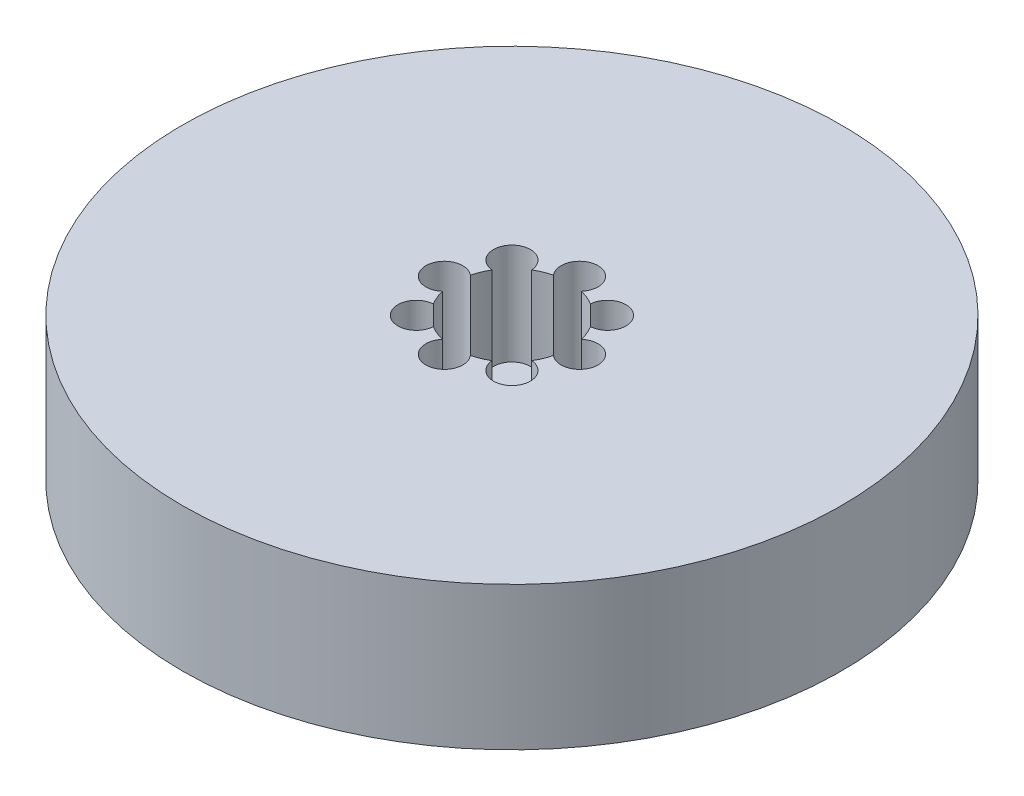
ISO-10303-21;
HEADER;
FILE_DESCRIPTION(('STEP AP214'),'2;1');
FILE_NAME('part.step','',(''),(''),'','','');
FILE_SCHEMA(('AUTOMOTIVE_DESIGN { 1 0 10303 214 1 1 1 1 }'));
ENDSEC;
DATA;
#1=APPLICATION_CONTEXT('core data for automotive mechanical design processes');
#2=APPLICATION_PROTOCOL_DEFINITION('international standard','automotive_design',2000,#1);
#3=PRODUCT_CONTEXT('',#1,'mechanical');
#4=PRODUCT('Part','Part','',(#3));
#5=PRODUCT_RELATED_PRODUCT_CATEGORY('part','',(#4));
#6=PRODUCT_DEFINITION_FORMATION('','',#4);
#7=PRODUCT_DEFINITION_CONTEXT('part definition',#1,'design');
#8=PRODUCT_DEFINITION('design','',#6,#7);
#9=PRODUCT_DEFINITION_SHAPE('','',#8);
#10=(LENGTH_UNIT() NAMED_UNIT(*) SI_UNIT(.MILLI.,.METRE.));
#11=(NAMED_UNIT(*) PLANE_ANGLE_UNIT() SI_UNIT($,.RADIAN.));
#12=(NAMED_UNIT(*) SI_UNIT($,.STERADIAN.) SOLID_ANGLE_UNIT());
#13=UNCERTAINTY_MEASURE_WITH_UNIT(LENGTH_MEASURE(1.E-05),#10,'distance_accuracy_value','');
#14=(GEOMETRIC_REPRESENTATION_CONTEXT(3) GLOBAL_UNCERTAINTY_ASSIGNED_CONTEXT((#13)) GLOBAL_UNIT_ASSIGNED_CONTEXT((#10,
#11,#12)) REPRESENTATION_CONTEXT('',''));
#15=CARTESIAN_POINT('',(0.,0.,0.));
#16=DIRECTION('',(0.,0.,1.));
#17=DIRECTION('',(1.,0.,0.));
#18=AXIS2_PLACEMENT_3D('',#15,#16,#17);
#19=CARTESIAN_POINT('',(0.,25.,0.));
#20=DIRECTION('',(0.,-1.,0.));
#21=DIRECTION('',(0.,0.,-1.));
#22=AXIS2_PLACEMENT_3D('',#19,#20,#21);
#23=CYLINDRICAL_SURFACE('',#22,57.5);
#24=CARTESIAN_POINT('',(0.,25.,0.));
#25=DIRECTION('',(0.,1.,0.));
#26=DIRECTION('',(0.,0.,1.));
#27=AXIS2_PLACEMENT_3D('',#24,#25,#26);
#28=CIRCLE('',#27,57.5);
#29=CARTESIAN_POINT('',(0.,25.,57.5));
#30=VERTEX_POINT('',#29);
#31=EDGE_CURVE('E195',#30,#30,#28,.T.);
#32=ORIENTED_EDGE('',*,*,#31,.F.);
#33=EDGE_LOOP('',(#32));
#34=FACE_BOUND('',#33,.T.);
#35=CARTESIAN_POINT('',(0.,0.,0.));
#36=DIRECTION('',(0.,1.,0.));
#37=DIRECTION('',(0.,0.,1.));
#38=AXIS2_PLACEMENT_3D('',#35,#36,#37);
#39=CIRCLE('',#38,57.5);
#40=CARTESIAN_POINT('',(0.,0.,57.5));
#41=VERTEX_POINT('',#40);
#42=EDGE_CURVE('E179',#41,#41,#39,.T.);
#43=ORIENTED_EDGE('',*,*,#42,.T.);
#44=EDGE_LOOP('',(#43));
#45=FACE_BOUND('',#44,.T.);
#46=ADVANCED_FACE('F39',(#34,#45),#23,.T.);
#47=CARTESIAN_POINT('',(0.,25.,0.));
#48=DIRECTION('',(0.,1.,0.));
#49=DIRECTION('',(0.,0.,1.));
#50=AXIS2_PLACEMENT_3D('',#47,#48,#49);
#51=PLANE('',#50);
#52=CARTESIAN_POINT('',(0.,25.,11.7935122991508));
#53=DIRECTION('',(0.,1.,0.));
#54=DIRECTION('',(1.,0.,0.));
#55=AXIS2_PLACEMENT_3D('',#52,#53,#54);
#56=CIRCLE('',#55,3.21900226584226);
#57=CARTESIAN_POINT('',(-2.44272235426867,25.,9.69706695346362));
#58=VERTEX_POINT('',#57);
#59=CARTESIAN_POINT('',(2.44272235426874,25.,9.6970669534636));
#60=VERTEX_POINT('',#59);
#61=EDGE_CURVE('E176',#58,#60,#56,.T.);
#62=ORIENTED_EDGE('',*,*,#61,.F.);
#63=CARTESIAN_POINT('',(0.,25.,0.));
#64=DIRECTION('',(0.,1.,0.));
#65=DIRECTION('',(0.,0.,1.));
#66=AXIS2_PLACEMENT_3D('',#63,#64,#65);
#67=CIRCLE('',#66,10.);
#68=CARTESIAN_POINT('',(-5.12959625915471,25.,8.58412734167347));
#69=VERTEX_POINT('',#68);
#70=EDGE_CURVE('E166',#69,#58,#67,.T.);
#71=ORIENTED_EDGE('',*,*,#70,.F.);
#72=CARTESIAN_POINT('',(-8.33927252073648,25.,8.33927252073651));
#73=DIRECTION('',(0.,1.,0.));
#74=DIRECTION('',(0.707106781186549,0.,0.707106781186546));
#75=AXIS2_PLACEMENT_3D('',#72,#73,#74);
#76=CIRCLE('',#75,3.21900226584226);
#77=CARTESIAN_POINT('',(-8.58412734167345,25.,5.12959625915474));
#78=VERTEX_POINT('',#77);
#79=EDGE_CURVE('E147',#78,#69,#76,.T.);
#80=ORIENTED_EDGE('',*,*,#79,.F.);
#81=CARTESIAN_POINT('',(-9.69706695346361,25.,2.4427223542687));
#82=VERTEX_POINT('',#81);
#83=EDGE_CURVE('E180',#82,#78,#67,.T.);
#84=ORIENTED_EDGE('',*,*,#83,.F.);
#85=CARTESIAN_POINT('',(-11.7935122991508,25.,0.));
#86=DIRECTION('',(0.,1.,0.));
#87=DIRECTION('',(0.,0.,1.));
#88=AXIS2_PLACEMENT_3D('',#85,#86,#87);
#89=CIRCLE('',#88,3.21900226584226);
#90=CARTESIAN_POINT('',(-9.69706695346361,25.,-2.4427223542687));
#91=VERTEX_POINT('',#90);
#92=EDGE_CURVE('E186',#91,#82,#89,.T.);
#93=ORIENTED_EDGE('',*,*,#92,.F.);
#94=CARTESIAN_POINT('',(-8.58412734167352,25.,-5.12959625915462));
#95=VERTEX_POINT('',#94);
#96=EDGE_CURVE('E182',#95,#91,#67,.T.);
#97=ORIENTED_EDGE('',*,*,#96,.F.);
#98=CARTESIAN_POINT('',(-8.3392725207366,25.,-8.33927252073639));
#99=DIRECTION('',(0.,1.,0.));
#100=DIRECTION('',(-0.707106781186539,0.,0.707106781186556));
#101=AXIS2_PLACEMENT_3D('',#98,#99,#100);
#102=CIRCLE('',#101,3.21900226584226);
#103=CARTESIAN_POINT('',(-5.12959625915483,25.,-8.5841273416734));
#104=VERTEX_POINT('',#103);
#105=EDGE_CURVE('E446',#104,#95,#102,.T.);
#106=ORIENTED_EDGE('',*,*,#105,.F.);
#107=CARTESIAN_POINT('',(-2.4427223542688,25.,-9.69706695346358));
#108=VERTEX_POINT('',#107);
#109=EDGE_CURVE('E452',#108,#104,#67,.T.);
#110=ORIENTED_EDGE('',*,*,#109,.F.);
#111=CARTESIAN_POINT('',(-1.23530484335706E-13,25.,-11.7935122991508));
#112=DIRECTION('',(0.,1.,0.));
#113=DIRECTION('',(-1.,0.,0.));
#114=AXIS2_PLACEMENT_3D('',#111,#112,#113);
#115=CIRCLE('',#114,3.21900226584226);
#116=CARTESIAN_POINT('',(2.4427223542686,25.,-9.69706695346363));
#117=VERTEX_POINT('',#116);
#118=EDGE_CURVE('E477',#117,#108,#115,.T.);
#119=ORIENTED_EDGE('',*,*,#118,.F.);
#120=CARTESIAN_POINT('',(5.12959625915465,25.,-8.58412734167351));
#121=VERTEX_POINT('',#120);
#122=EDGE_CURVE('E460',#121,#117,#67,.T.);
#123=ORIENTED_EDGE('',*,*,#122,.F.);
#124=CARTESIAN_POINT('',(8.33927252073642,25.,-8.33927252073657));
#125=DIRECTION('',(0.,1.,0.));
#126=DIRECTION('',(-0.707106781186554,0.,-0.707106781186541));
#127=AXIS2_PLACEMENT_3D('',#124,#125,#126);
#128=CIRCLE('',#127,3.21900226584226);
#129=CARTESIAN_POINT('',(8.58412734167342,25.,-5.1295962591548));
#130=VERTEX_POINT('',#129);
#131=EDGE_CURVE('E464',#130,#121,#128,.T.);
#132=ORIENTED_EDGE('',*,*,#131,.F.);
#133=CARTESIAN_POINT('',(9.69706695346361,25.,-2.4427223542687));
#134=VERTEX_POINT('',#133);
#135=EDGE_CURVE('E459',#134,#130,#67,.T.);
#136=ORIENTED_EDGE('',*,*,#135,.F.);
#137=CARTESIAN_POINT('',(11.7935122991508,25.,0.));
#138=DIRECTION('',(0.,1.,0.));
#139=DIRECTION('',(0.,0.,-1.));
#140=AXIS2_PLACEMENT_3D('',#137,#138,#139);
#141=CIRCLE('',#140,3.21900226584226);
#142=CARTESIAN_POINT('',(9.69706695346361,25.,2.4427223542687));
#143=VERTEX_POINT('',#142);
#144=EDGE_CURVE('E469',#143,#134,#141,.T.);
#145=ORIENTED_EDGE('',*,*,#144,.F.);
#146=CARTESIAN_POINT('',(8.58412734167349,25.,5.12959625915468));
#147=VERTEX_POINT('',#146);
#148=EDGE_CURVE('E181',#147,#143,#67,.T.);
#149=ORIENTED_EDGE('',*,*,#148,.F.);
#150=CARTESIAN_POINT('',(8.33927252073654,25.,8.33927252073645));
#151=DIRECTION('',(0.,1.,0.));
#152=DIRECTION('',(0.707106781186544,0.,-0.707106781186551));
#153=AXIS2_PLACEMENT_3D('',#150,#151,#152);
#154=CIRCLE('',#153,3.21900226584226);
#155=CARTESIAN_POINT('',(5.12959625915477,25.,8.58412734167343));
#156=VERTEX_POINT('',#155);
#157=EDGE_CURVE('E475',#156,#147,#154,.T.);
#158=ORIENTED_EDGE('',*,*,#157,.F.);
#159=EDGE_CURVE('E177',#60,#156,#67,.T.);
#160=ORIENTED_EDGE('',*,*,#159,.F.);
#161=EDGE_LOOP('',(#62,#71,#80,#84,#93,#97,#106,#110,#119,#123,#132,#136,#145,#149,#158,#160));
#162=FACE_BOUND('',#161,.T.);
#163=ORIENTED_EDGE('',*,*,#31,.T.);
#164=EDGE_LOOP('',(#163));
#165=FACE_BOUND('',#164,.T.);
#166=ADVANCED_FACE('F172',(#162,#165),#51,.T.);
#167=CARTESIAN_POINT('',(0.,0.,0.));
#168=DIRECTION('',(0.,1.,0.));
#169=DIRECTION('',(0.,0.,1.));
#170=AXIS2_PLACEMENT_3D('',#167,#168,#169);
#171=PLANE('',#170);
#172=CARTESIAN_POINT('',(0.,0.,0.));
#173=DIRECTION('',(0.,1.,0.));
#174=DIRECTION('',(0.,0.,1.));
#175=AXIS2_PLACEMENT_3D('',#172,#173,#174);
#176=CIRCLE('',#175,10.);
#177=CARTESIAN_POINT('',(0.,0.,10.));
#178=VERTEX_POINT('',#177);
#179=EDGE_CURVE('E187',#178,#178,#176,.T.);
#180=ORIENTED_EDGE('',*,*,#179,.T.);
#181=EDGE_LOOP('',(#180));
#182=FACE_BOUND('',#181,.T.);
#183=ORIENTED_EDGE('',*,*,#42,.F.);
#184=EDGE_LOOP('',(#183));
#185=FACE_BOUND('',#184,.T.);
#186=ADVANCED_FACE('F270',(#182,#185),#171,.F.);
#187=CARTESIAN_POINT('',(0.,25.,0.));
#188=DIRECTION('',(0.,-1.,0.));
#189=DIRECTION('',(0.,0.,-1.));
#190=AXIS2_PLACEMENT_3D('',#187,#188,#189);
#191=CYLINDRICAL_SURFACE('',#190,10.);
#192=DIRECTION('',(0.,1.,0.));
#193=VECTOR('',#192,1.);
#194=CARTESIAN_POINT('',(-2.44272235426867,16.1651851618745,9.69706695346362));
#195=LINE('',#194,#193);
#196=CARTESIAN_POINT('',(-2.44272235426867,7.33037032374907,9.69706695346362));
#197=VERTEX_POINT('',#196);
#198=EDGE_CURVE('E11',#197,#58,#195,.T.);
#199=ORIENTED_EDGE('',*,*,#198,.F.);
#200=CARTESIAN_POINT('',(0.,7.33037032374907,0.));
#201=DIRECTION('',(0.,1.,0.));
#202=DIRECTION('',(0.,0.,1.));
#203=AXIS2_PLACEMENT_3D('',#200,#201,#202);
#204=CIRCLE('',#203,10.);
#205=CARTESIAN_POINT('',(2.44272235426874,7.33037032374907,9.6970669534636));
#206=VERTEX_POINT('',#205);
#207=EDGE_CURVE('E250',#197,#206,#204,.T.);
#208=ORIENTED_EDGE('',*,*,#207,.T.);
#209=DIRECTION('',(0.,1.,0.));
#210=VECTOR('',#209,1.);
#211=CARTESIAN_POINT('',(2.44272235426874,16.1651851618745,9.6970669534636));
#212=LINE('',#211,#210);
#213=EDGE_CURVE('E46',#60,#206,#212,.F.);
#214=ORIENTED_EDGE('',*,*,#213,.F.);
#215=ORIENTED_EDGE('',*,*,#159,.T.);
#216=DIRECTION('',(0.,1.,0.));
#217=VECTOR('',#216,1.);
#218=CARTESIAN_POINT('',(5.12959625915477,16.1651851618745,8.58412734167343));
#219=LINE('',#218,#217);
#220=CARTESIAN_POINT('',(5.12959625915477,7.33037032374907,8.58412734167343));
#221=VERTEX_POINT('',#220);
#222=EDGE_CURVE('E244',#221,#156,#219,.T.);
#223=ORIENTED_EDGE('',*,*,#222,.F.);
#224=CARTESIAN_POINT('',(0.,7.33037032374907,0.));
#225=DIRECTION('',(0.,1.,0.));
#226=DIRECTION('',(0.,0.,1.));
#227=AXIS2_PLACEMENT_3D('',#224,#225,#226);
#228=CIRCLE('',#227,10.);
#229=CARTESIAN_POINT('',(8.58412734167349,7.33037032374907,5.12959625915468));
#230=VERTEX_POINT('',#229);
#231=EDGE_CURVE('E238',#221,#230,#228,.T.);
#232=ORIENTED_EDGE('',*,*,#231,.T.);
#233=DIRECTION('',(0.,1.,0.));
#234=VECTOR('',#233,1.);
#235=CARTESIAN_POINT('',(8.58412734167349,16.1651851618745,5.12959625915468));
#236=LINE('',#235,#234);
#237=EDGE_CURVE('E242',#147,#230,#236,.F.);
#238=ORIENTED_EDGE('',*,*,#237,.F.);
#239=ORIENTED_EDGE('',*,*,#148,.T.);
#240=DIRECTION('',(0.,1.,0.));
#241=VECTOR('',#240,1.);
#242=CARTESIAN_POINT('',(9.69706695346361,16.1651851618745,2.4427223542687));
#243=LINE('',#242,#241);
#244=CARTESIAN_POINT('',(9.69706695346361,7.33037032374907,2.4427223542687));
#245=VERTEX_POINT('',#244);
#246=EDGE_CURVE('E236',#245,#143,#243,.T.);
#247=ORIENTED_EDGE('',*,*,#246,.F.);
#248=CARTESIAN_POINT('',(0.,7.33037032374907,0.));
#249=DIRECTION('',(0.,1.,0.));
#250=DIRECTION('',(0.,0.,1.));
#251=AXIS2_PLACEMENT_3D('',#248,#249,#250);
#252=CIRCLE('',#251,10.);
#253=CARTESIAN_POINT('',(9.69706695346361,7.33037032374907,-2.4427223542687));
#254=VERTEX_POINT('',#253);
#255=EDGE_CURVE('E235',#245,#254,#252,.T.);
#256=ORIENTED_EDGE('',*,*,#255,.T.);
#257=DIRECTION('',(0.,1.,0.));
#258=VECTOR('',#257,1.);
#259=CARTESIAN_POINT('',(9.69706695346361,16.1651851618745,-2.4427223542687));
#260=LINE('',#259,#258);
#261=EDGE_CURVE('E234',#134,#254,#260,.F.);
#262=ORIENTED_EDGE('',*,*,#261,.F.);
#263=ORIENTED_EDGE('',*,*,#135,.T.);
#264=DIRECTION('',(0.,1.,0.));
#265=VECTOR('',#264,1.);
#266=CARTESIAN_POINT('',(8.58412734167342,16.1651851618745,-5.1295962591548));
#267=LINE('',#266,#265);
#268=CARTESIAN_POINT('',(8.58412734167342,7.33037032374907,-5.1295962591548));
#269=VERTEX_POINT('',#268);
#270=EDGE_CURVE('E229',#269,#130,#267,.T.);
#271=ORIENTED_EDGE('',*,*,#270,.F.);
#272=CARTESIAN_POINT('',(0.,7.33037032374907,0.));
#273=DIRECTION('',(0.,1.,0.));
#274=DIRECTION('',(0.,0.,1.));
#275=AXIS2_PLACEMENT_3D('',#272,#273,#274);
#276=CIRCLE('',#275,10.);
#277=CARTESIAN_POINT('',(5.12959625915465,7.33037032374907,-8.58412734167351));
#278=VERTEX_POINT('',#277);
#279=EDGE_CURVE('E221',#269,#278,#276,.T.);
#280=ORIENTED_EDGE('',*,*,#279,.T.);
#281=DIRECTION('',(0.,1.,0.));
#282=VECTOR('',#281,1.);
#283=CARTESIAN_POINT('',(5.12959625915465,16.1651851618745,-8.5841273416735));
#284=LINE('',#283,#282);
#285=EDGE_CURVE('E230',#121,#278,#284,.F.);
#286=ORIENTED_EDGE('',*,*,#285,.F.);
#287=ORIENTED_EDGE('',*,*,#122,.T.);
#288=DIRECTION('',(0.,1.,0.));
#289=VECTOR('',#288,1.);
#290=CARTESIAN_POINT('',(2.4427223542686,16.1651851618745,-9.69706695346363));
#291=LINE('',#290,#289);
#292=CARTESIAN_POINT('',(2.4427223542686,7.33037032374907,-9.69706695346363));
#293=VERTEX_POINT('',#292);
#294=EDGE_CURVE('E225',#293,#117,#291,.T.);
#295=ORIENTED_EDGE('',*,*,#294,.F.);
#296=CARTESIAN_POINT('',(0.,7.33037032374907,0.));
#297=DIRECTION('',(0.,1.,0.));
#298=DIRECTION('',(0.,0.,1.));
#299=AXIS2_PLACEMENT_3D('',#296,#297,#298);
#300=CIRCLE('',#299,10.);
#301=CARTESIAN_POINT('',(-2.4427223542688,7.33037032374907,-9.69706695346358));
#302=VERTEX_POINT('',#301);
#303=EDGE_CURVE('E216',#293,#302,#300,.T.);
#304=ORIENTED_EDGE('',*,*,#303,.T.);
#305=DIRECTION('',(0.,1.,0.));
#306=VECTOR('',#305,1.);
#307=CARTESIAN_POINT('',(-2.4427223542688,16.1651851618745,-9.69706695346358));
#308=LINE('',#307,#306);
#309=EDGE_CURVE('E218',#108,#302,#308,.F.);
#310=ORIENTED_EDGE('',*,*,#309,.F.);
#311=ORIENTED_EDGE('',*,*,#109,.T.);
#312=DIRECTION('',(0.,1.,0.));
#313=VECTOR('',#312,1.);
#314=CARTESIAN_POINT('',(-5.12959625915483,16.1651851618745,-8.5841273416734));
#315=LINE('',#314,#313);
#316=CARTESIAN_POINT('',(-5.12959625915483,7.33037032374907,-8.5841273416734));
#317=VERTEX_POINT('',#316);
#318=EDGE_CURVE('E212',#317,#104,#315,.T.);
#319=ORIENTED_EDGE('',*,*,#318,.F.);
#320=CARTESIAN_POINT('',(0.,7.33037032374907,0.));
#321=DIRECTION('',(0.,1.,0.));
#322=DIRECTION('',(0.,0.,1.));
#323=AXIS2_PLACEMENT_3D('',#320,#321,#322);
#324=CIRCLE('',#323,10.);
#325=CARTESIAN_POINT('',(-8.58412734167352,7.33037032374907,-5.12959625915462));
#326=VERTEX_POINT('',#325);
#327=EDGE_CURVE('E208',#317,#326,#324,.T.);
#328=ORIENTED_EDGE('',*,*,#327,.T.);
#329=DIRECTION('',(0.,1.,0.));
#330=VECTOR('',#329,1.);
#331=CARTESIAN_POINT('',(-8.58412734167352,16.1651851618745,-5.12959625915462));
#332=LINE('',#331,#330);
#333=EDGE_CURVE('E211',#95,#326,#332,.F.);
#334=ORIENTED_EDGE('',*,*,#333,.F.);
#335=ORIENTED_EDGE('',*,*,#96,.T.);
#336=DIRECTION('',(0.,1.,0.));
#337=VECTOR('',#336,1.);
#338=CARTESIAN_POINT('',(-9.69706695346361,16.1651851618745,-2.4427223542687));
#339=LINE('',#338,#337);
#340=CARTESIAN_POINT('',(-9.69706695346361,7.33037032374907,-2.4427223542687));
#341=VERTEX_POINT('',#340);
#342=EDGE_CURVE('E201',#341,#91,#339,.T.);
#343=ORIENTED_EDGE('',*,*,#342,.F.);
#344=CARTESIAN_POINT('',(0.,7.33037032374907,0.));
#345=DIRECTION('',(0.,1.,0.));
#346=DIRECTION('',(0.,0.,1.));
#347=AXIS2_PLACEMENT_3D('',#344,#345,#346);
#348=CIRCLE('',#347,10.);
#349=CARTESIAN_POINT('',(-9.69706695346361,7.33037032374907,2.4427223542687));
#350=VERTEX_POINT('',#349);
#351=EDGE_CURVE('E194',#341,#350,#348,.T.);
#352=ORIENTED_EDGE('',*,*,#351,.T.);
#353=DIRECTION('',(0.,1.,0.));
#354=VECTOR('',#353,1.);
#355=CARTESIAN_POINT('',(-9.69706695346361,16.1651851618745,2.4427223542687));
#356=LINE('',#355,#354);
#357=EDGE_CURVE('E199',#82,#350,#356,.F.);
#358=ORIENTED_EDGE('',*,*,#357,.F.);
#359=ORIENTED_EDGE('',*,*,#83,.T.);
#360=DIRECTION('',(0.,1.,0.));
#361=VECTOR('',#360,1.);
#362=CARTESIAN_POINT('',(-8.58412734167345,16.1651851618745,5.12959625915474));
#363=LINE('',#362,#361);
#364=CARTESIAN_POINT('',(-8.58412734167345,7.33037032374907,5.12959625915474));
#365=VERTEX_POINT('',#364);
#366=EDGE_CURVE('E160',#365,#78,#363,.T.);
#367=ORIENTED_EDGE('',*,*,#366,.F.);
#368=CARTESIAN_POINT('',(0.,7.33037032374907,0.));
#369=DIRECTION('',(0.,1.,0.));
#370=DIRECTION('',(0.,0.,1.));
#371=AXIS2_PLACEMENT_3D('',#368,#369,#370);
#372=CIRCLE('',#371,10.);
#373=CARTESIAN_POINT('',(-5.12959625915471,7.33037032374907,8.58412734167347));
#374=VERTEX_POINT('',#373);
#375=EDGE_CURVE('E168',#365,#374,#372,.T.);
#376=ORIENTED_EDGE('',*,*,#375,.T.);
#377=DIRECTION('',(0.,1.,0.));
#378=VECTOR('',#377,1.);
#379=CARTESIAN_POINT('',(-5.12959625915471,16.1651851618745,8.58412734167347));
#380=LINE('',#379,#378);
#381=EDGE_CURVE('E152',#69,#374,#380,.F.);
#382=ORIENTED_EDGE('',*,*,#381,.F.);
#383=ORIENTED_EDGE('',*,*,#70,.T.);
#384=EDGE_LOOP('',(#199,#208,#214,#215,#223,#232,#238,#239,#247,#256,#262,#263,#271,#280,#286,
#287,#295,#304,#310,#311,#319,#328,#334,#335,#343,#352,#358,#359,#367,#376,#382,#383));
#385=FACE_BOUND('',#384,.T.);
#386=ORIENTED_EDGE('',*,*,#179,.F.);
#387=EDGE_LOOP('',(#386));
#388=FACE_BOUND('',#387,.T.);
#389=ADVANCED_FACE('F170',(#385,#388),#191,.F.);
#390=CARTESIAN_POINT('',(-11.7935122991508,7.33037032374907,0.));
#391=DIRECTION('',(0.,1.,0.));
#392=DIRECTION('',(0.,0.,1.));
#393=AXIS2_PLACEMENT_3D('',#390,#391,#392);
#394=CYLINDRICAL_SURFACE('',#393,3.21900226584226);
#395=ORIENTED_EDGE('',*,*,#342,.T.);
#396=ORIENTED_EDGE('',*,*,#92,.T.);
#397=ORIENTED_EDGE('',*,*,#357,.T.);
#398=CARTESIAN_POINT('',(-11.7935122991508,7.33037032374907,0.));
#399=DIRECTION('',(0.,1.,0.));
#400=DIRECTION('',(0.,0.,1.));
#401=AXIS2_PLACEMENT_3D('',#398,#399,#400);
#402=CIRCLE('',#401,3.21900226584226);
#403=EDGE_CURVE('E191',#341,#350,#402,.T.);
#404=ORIENTED_EDGE('',*,*,#403,.F.);
#405=EDGE_LOOP('',(#395,#396,#397,#404));
#406=FACE_BOUND('',#405,.T.);
#407=ADVANCED_FACE('F279',(#406),#394,.F.);
#408=CARTESIAN_POINT('',(-11.7935122991508,7.33037032374907,0.));
#409=DIRECTION('',(0.,1.,0.));
#410=DIRECTION('',(0.,0.,1.));
#411=AXIS2_PLACEMENT_3D('',#408,#409,#410);
#412=PLANE('',#411);
#413=ORIENTED_EDGE('',*,*,#403,.T.);
#414=ORIENTED_EDGE('',*,*,#351,.F.);
#415=EDGE_LOOP('',(#413,#414));
#416=FACE_BOUND('',#415,.T.);
#417=ADVANCED_FACE('F285',(#416),#412,.T.);
#418=CARTESIAN_POINT('',(-8.33927252073648,7.33037032374907,8.33927252073651));
#419=DIRECTION('',(0.,1.,0.));
#420=DIRECTION('',(0.,0.,1.));
#421=AXIS2_PLACEMENT_3D('',#418,#419,#420);
#422=CYLINDRICAL_SURFACE('',#421,3.21900226584226);
#423=ORIENTED_EDGE('',*,*,#366,.T.);
#424=ORIENTED_EDGE('',*,*,#79,.T.);
#425=ORIENTED_EDGE('',*,*,#381,.T.);
#426=CARTESIAN_POINT('',(-8.33927252073648,7.33037032374907,8.33927252073651));
#427=DIRECTION('',(0.,1.,0.));
#428=DIRECTION('',(0.707106781186549,0.,0.707106781186546));
#429=AXIS2_PLACEMENT_3D('',#426,#427,#428);
#430=CIRCLE('',#429,3.21900226584226);
#431=EDGE_CURVE('E165',#365,#374,#430,.T.);
#432=ORIENTED_EDGE('',*,*,#431,.F.);
#433=EDGE_LOOP('',(#423,#424,#425,#432));
#434=FACE_BOUND('',#433,.T.);
#435=ADVANCED_FACE('F155',(#434),#422,.F.);
#436=CARTESIAN_POINT('',(-8.33927252073648,7.33037032374907,8.33927252073651));
#437=DIRECTION('',(0.,1.,0.));
#438=DIRECTION('',(0.707106781186549,0.,0.707106781186546));
#439=AXIS2_PLACEMENT_3D('',#436,#437,#438);
#440=PLANE('',#439);
#441=ORIENTED_EDGE('',*,*,#431,.T.);
#442=ORIENTED_EDGE('',*,*,#375,.F.);
#443=EDGE_LOOP('',(#441,#442));
#444=FACE_BOUND('',#443,.T.);
#445=ADVANCED_FACE('F288',(#444),#440,.T.);
#446=CARTESIAN_POINT('',(-8.3392725207366,7.33037032374907,-8.33927252073639));
#447=DIRECTION('',(0.,1.,0.));
#448=DIRECTION('',(0.,0.,1.));
#449=AXIS2_PLACEMENT_3D('',#446,#447,#448);
#450=CYLINDRICAL_SURFACE('',#449,3.21900226584226);
#451=ORIENTED_EDGE('',*,*,#318,.T.);
#452=ORIENTED_EDGE('',*,*,#105,.T.);
#453=ORIENTED_EDGE('',*,*,#333,.T.);
#454=CARTESIAN_POINT('',(-8.3392725207366,7.33037032374907,-8.33927252073639));
#455=DIRECTION('',(0.,1.,0.));
#456=DIRECTION('',(-0.707106781186539,0.,0.707106781186556));
#457=AXIS2_PLACEMENT_3D('',#454,#455,#456);
#458=CIRCLE('',#457,3.21900226584226);
#459=EDGE_CURVE('E447',#317,#326,#458,.T.);
#460=ORIENTED_EDGE('',*,*,#459,.F.);
#461=EDGE_LOOP('',(#451,#452,#453,#460));
#462=FACE_BOUND('',#461,.T.);
#463=ADVANCED_FACE('F295',(#462),#450,.F.);
#464=CARTESIAN_POINT('',(-8.3392725207366,7.33037032374907,-8.33927252073639));
#465=DIRECTION('',(0.,1.,0.));
#466=DIRECTION('',(-0.707106781186539,0.,0.707106781186556));
#467=AXIS2_PLACEMENT_3D('',#464,#465,#466);
#468=PLANE('',#467);
#469=ORIENTED_EDGE('',*,*,#459,.T.);
#470=ORIENTED_EDGE('',*,*,#327,.F.);
#471=EDGE_LOOP('',(#469,#470));
#472=FACE_BOUND('',#471,.T.);
#473=ADVANCED_FACE('F375',(#472),#468,.T.);
#474=CARTESIAN_POINT('',(-1.23530484335706E-13,7.33037032374907,-11.7935122991508));
#475=DIRECTION('',(0.,1.,0.));
#476=DIRECTION('',(0.,0.,1.));
#477=AXIS2_PLACEMENT_3D('',#474,#475,#476);
#478=CYLINDRICAL_SURFACE('',#477,3.21900226584226);
#479=ORIENTED_EDGE('',*,*,#294,.T.);
#480=ORIENTED_EDGE('',*,*,#118,.T.);
#481=ORIENTED_EDGE('',*,*,#309,.T.);
#482=CARTESIAN_POINT('',(-1.23530484335706E-13,7.33037032374907,-11.7935122991508));
#483=DIRECTION('',(0.,1.,0.));
#484=DIRECTION('',(-1.,0.,0.));
#485=AXIS2_PLACEMENT_3D('',#482,#483,#484);
#486=CIRCLE('',#485,3.21900226584226);
#487=EDGE_CURVE('E467',#293,#302,#486,.T.);
#488=ORIENTED_EDGE('',*,*,#487,.F.);
#489=EDGE_LOOP('',(#479,#480,#481,#488));
#490=FACE_BOUND('',#489,.T.);
#491=ADVANCED_FACE('F361',(#490),#478,.F.);
#492=CARTESIAN_POINT('',(-1.23530484335706E-13,7.33037032374907,-11.7935122991508));
#493=DIRECTION('',(0.,1.,0.));
#494=DIRECTION('',(-1.,0.,0.));
#495=AXIS2_PLACEMENT_3D('',#492,#493,#494);
#496=PLANE('',#495);
#497=ORIENTED_EDGE('',*,*,#487,.T.);
#498=ORIENTED_EDGE('',*,*,#303,.F.);
#499=EDGE_LOOP('',(#497,#498));
#500=FACE_BOUND('',#499,.T.);
#501=ADVANCED_FACE('F297',(#500),#496,.T.);
#502=CARTESIAN_POINT('',(8.33927252073642,7.33037032374907,-8.33927252073657));
#503=DIRECTION('',(0.,1.,0.));
#504=DIRECTION('',(0.,0.,1.));
#505=AXIS2_PLACEMENT_3D('',#502,#503,#504);
#506=CYLINDRICAL_SURFACE('',#505,3.21900226584226);
#507=ORIENTED_EDGE('',*,*,#270,.T.);
#508=ORIENTED_EDGE('',*,*,#131,.T.);
#509=ORIENTED_EDGE('',*,*,#285,.T.);
#510=CARTESIAN_POINT('',(8.33927252073642,7.33037032374907,-8.33927252073657));
#511=DIRECTION('',(0.,1.,0.));
#512=DIRECTION('',(-0.707106781186554,0.,-0.707106781186541));
#513=AXIS2_PLACEMENT_3D('',#510,#511,#512);
#514=CIRCLE('',#513,3.21900226584226);
#515=EDGE_CURVE('E470',#269,#278,#514,.T.);
#516=ORIENTED_EDGE('',*,*,#515,.F.);
#517=EDGE_LOOP('',(#507,#508,#509,#516));
#518=FACE_BOUND('',#517,.T.);
#519=ADVANCED_FACE('F294',(#518),#506,.F.);
#520=CARTESIAN_POINT('',(8.33927252073642,7.33037032374907,-8.33927252073657));
#521=DIRECTION('',(0.,1.,0.));
#522=DIRECTION('',(-0.707106781186554,0.,-0.707106781186541));
#523=AXIS2_PLACEMENT_3D('',#520,#521,#522);
#524=PLANE('',#523);
#525=ORIENTED_EDGE('',*,*,#515,.T.);
#526=ORIENTED_EDGE('',*,*,#279,.F.);
#527=EDGE_LOOP('',(#525,#526));
#528=FACE_BOUND('',#527,.T.);
#529=ADVANCED_FACE('F300',(#528),#524,.T.);
#530=CARTESIAN_POINT('',(11.7935122991508,7.33037032374907,0.));
#531=DIRECTION('',(0.,1.,0.));
#532=DIRECTION('',(0.,0.,1.));
#533=AXIS2_PLACEMENT_3D('',#530,#531,#532);
#534=CYLINDRICAL_SURFACE('',#533,3.21900226584226);
#535=ORIENTED_EDGE('',*,*,#246,.T.);
#536=ORIENTED_EDGE('',*,*,#144,.T.);
#537=ORIENTED_EDGE('',*,*,#261,.T.);
#538=CARTESIAN_POINT('',(11.7935122991508,7.33037032374907,0.));
#539=DIRECTION('',(0.,1.,0.));
#540=DIRECTION('',(0.,0.,-1.));
#541=AXIS2_PLACEMENT_3D('',#538,#539,#540);
#542=CIRCLE('',#541,3.21900226584226);
#543=EDGE_CURVE('E472',#245,#254,#542,.T.);
#544=ORIENTED_EDGE('',*,*,#543,.F.);
#545=EDGE_LOOP('',(#535,#536,#537,#544));
#546=FACE_BOUND('',#545,.T.);
#547=ADVANCED_FACE('F305',(#546),#534,.F.);
#548=CARTESIAN_POINT('',(11.7935122991508,7.33037032374907,0.));
#549=DIRECTION('',(0.,1.,0.));
#550=DIRECTION('',(0.,0.,-1.));
#551=AXIS2_PLACEMENT_3D('',#548,#549,#550);
#552=PLANE('',#551);
#553=ORIENTED_EDGE('',*,*,#543,.T.);
#554=ORIENTED_EDGE('',*,*,#255,.F.);
#555=EDGE_LOOP('',(#553,#554));
#556=FACE_BOUND('',#555,.T.);
#557=ADVANCED_FACE('F308',(#556),#552,.T.);
#558=CARTESIAN_POINT('',(8.33927252073654,7.33037032374907,8.33927252073645));
#559=DIRECTION('',(0.,1.,0.));
#560=DIRECTION('',(0.,0.,1.));
#561=AXIS2_PLACEMENT_3D('',#558,#559,#560);
#562=CYLINDRICAL_SURFACE('',#561,3.21900226584226);
#563=ORIENTED_EDGE('',*,*,#222,.T.);
#564=ORIENTED_EDGE('',*,*,#157,.T.);
#565=ORIENTED_EDGE('',*,*,#237,.T.);
#566=CARTESIAN_POINT('',(8.33927252073654,7.33037032374907,8.33927252073645));
#567=DIRECTION('',(0.,1.,0.));
#568=DIRECTION('',(0.707106781186544,0.,-0.707106781186551));
#569=AXIS2_PLACEMENT_3D('',#566,#567,#568);
#570=CIRCLE('',#569,3.21900226584226);
#571=EDGE_CURVE('E56',#221,#230,#570,.T.);
#572=ORIENTED_EDGE('',*,*,#571,.F.);
#573=EDGE_LOOP('',(#563,#564,#565,#572));
#574=FACE_BOUND('',#573,.T.);
#575=ADVANCED_FACE('F309',(#574),#562,.F.);
#576=CARTESIAN_POINT('',(8.33927252073654,7.33037032374907,8.33927252073645));
#577=DIRECTION('',(0.,1.,0.));
#578=DIRECTION('',(0.707106781186544,0.,-0.707106781186551));
#579=AXIS2_PLACEMENT_3D('',#576,#577,#578);
#580=PLANE('',#579);
#581=ORIENTED_EDGE('',*,*,#571,.T.);
#582=ORIENTED_EDGE('',*,*,#231,.F.);
#583=EDGE_LOOP('',(#581,#582));
#584=FACE_BOUND('',#583,.T.);
#585=ADVANCED_FACE('F256',(#584),#580,.T.);
#586=CARTESIAN_POINT('',(0.,7.33037032374907,11.7935122991508));
#587=DIRECTION('',(0.,1.,0.));
#588=DIRECTION('',(0.,0.,1.));
#589=AXIS2_PLACEMENT_3D('',#586,#587,#588);
#590=CYLINDRICAL_SURFACE('',#589,3.21900226584226);
#591=ORIENTED_EDGE('',*,*,#198,.T.);
#592=ORIENTED_EDGE('',*,*,#61,.T.);
#593=ORIENTED_EDGE('',*,*,#213,.T.);
#594=CARTESIAN_POINT('',(0.,7.33037032374907,11.7935122991508));
#595=DIRECTION('',(0.,1.,0.));
#596=DIRECTION('',(1.,0.,0.));
#597=AXIS2_PLACEMENT_3D('',#594,#595,#596);
#598=CIRCLE('',#597,3.21900226584226);
#599=EDGE_CURVE('E55',#197,#206,#598,.T.);
#600=ORIENTED_EDGE('',*,*,#599,.F.);
#601=EDGE_LOOP('',(#591,#592,#593,#600));
#602=FACE_BOUND('',#601,.T.);
#603=ADVANCED_FACE('F253',(#602),#590,.F.);
#604=CARTESIAN_POINT('',(0.,7.33037032374907,11.7935122991508));
#605=DIRECTION('',(0.,1.,0.));
#606=DIRECTION('',(1.,0.,0.));
#607=AXIS2_PLACEMENT_3D('',#604,#605,#606);
#608=PLANE('',#607);
#609=ORIENTED_EDGE('',*,*,#599,.T.);
#610=ORIENTED_EDGE('',*,*,#207,.F.);
#611=EDGE_LOOP('',(#609,#610));
#612=FACE_BOUND('',#611,.T.);
#613=ADVANCED_FACE('F252',(#612),#608,.T.);
#614=CLOSED_SHELL('',(#46,#166,#186,#389,#407,#417,#435,#445,#463,#473,#491,#501,#519,#529,#547,
#557,#575,#585,#603,#613));
#615=MANIFOLD_SOLID_BREP('B2',#614);
#616=ADVANCED_BREP_SHAPE_REPRESENTATION('',(#18,#615),#14);
#617=SHAPE_DEFINITION_REPRESENTATION(#9,#616);
ENDSEC;
END-ISO-10303-21;
